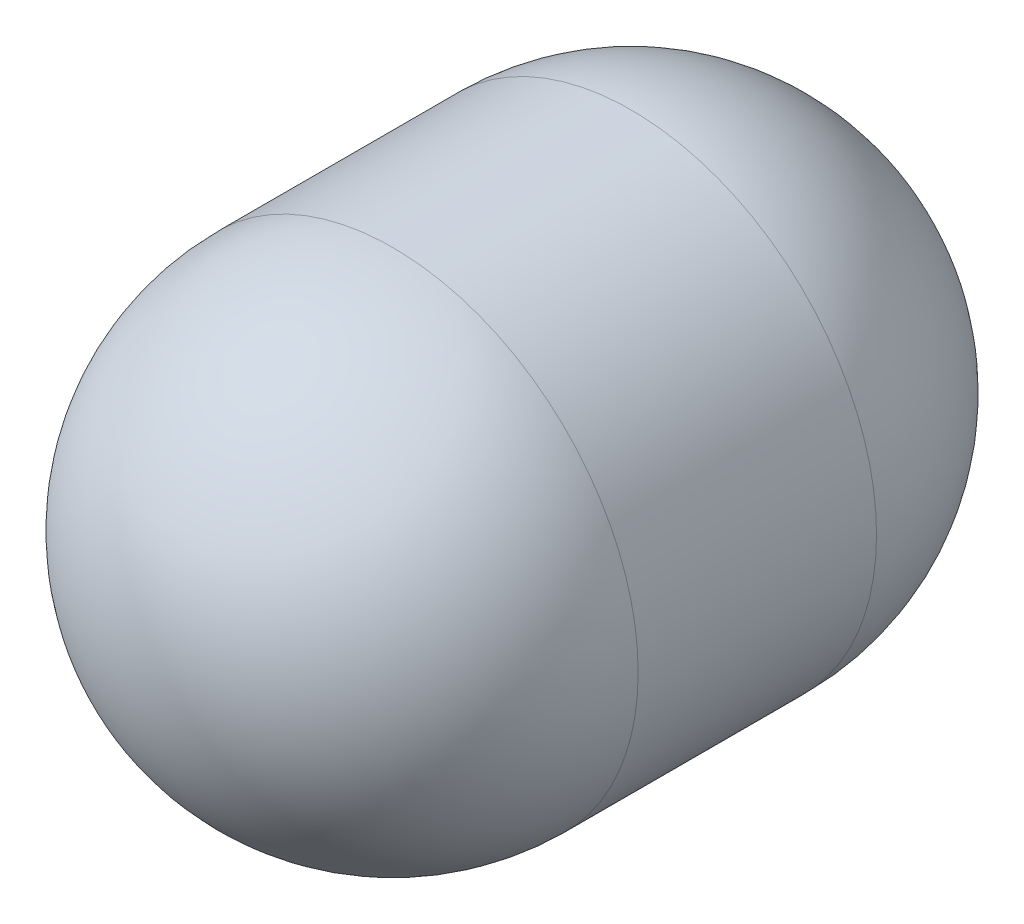
ISO-10303-21;
HEADER;
FILE_DESCRIPTION(('STEP AP214'),'2;1');
FILE_NAME('part.step','',(''),(''),'','','');
FILE_SCHEMA(('AUTOMOTIVE_DESIGN { 1 0 10303 214 1 1 1 1 }'));
ENDSEC;
DATA;
#1=APPLICATION_CONTEXT('core data for automotive mechanical design processes');
#2=APPLICATION_PROTOCOL_DEFINITION('international standard','automotive_design',2000,#1);
#3=PRODUCT_CONTEXT('',#1,'mechanical');
#4=PRODUCT('Part','Part','',(#3));
#5=PRODUCT_RELATED_PRODUCT_CATEGORY('part','',(#4));
#6=PRODUCT_DEFINITION_FORMATION('','',#4);
#7=PRODUCT_DEFINITION_CONTEXT('part definition',#1,'design');
#8=PRODUCT_DEFINITION('design','',#6,#7);
#9=PRODUCT_DEFINITION_SHAPE('','',#8);
#10=(LENGTH_UNIT() NAMED_UNIT(*) SI_UNIT(.MILLI.,.METRE.));
#11=(NAMED_UNIT(*) PLANE_ANGLE_UNIT() SI_UNIT($,.RADIAN.));
#12=(NAMED_UNIT(*) SI_UNIT($,.STERADIAN.) SOLID_ANGLE_UNIT());
#13=UNCERTAINTY_MEASURE_WITH_UNIT(LENGTH_MEASURE(1.E-05),#10,'distance_accuracy_value','');
#14=(GEOMETRIC_REPRESENTATION_CONTEXT(3) GLOBAL_UNCERTAINTY_ASSIGNED_CONTEXT((#13)) GLOBAL_UNIT_ASSIGNED_CONTEXT((#10,
#11,#12)) REPRESENTATION_CONTEXT('',''));
#15=CARTESIAN_POINT('',(0.,0.,0.));
#16=DIRECTION('',(0.,0.,1.));
#17=DIRECTION('',(1.,0.,0.));
#18=AXIS2_PLACEMENT_3D('',#15,#16,#17);
#19=CARTESIAN_POINT('',(0.,0.,-80.6816221177886));
#20=DIRECTION('',(0.,0.,-1.));
#21=DIRECTION('',(-1.,0.,0.));
#22=AXIS2_PLACEMENT_3D('',#19,#20,#21);
#23=CYLINDRICAL_SURFACE('',#22,55.5625);
#24=CARTESIAN_POINT('',(0.,0.,-26.9875));
#25=DIRECTION('',(0.,0.,-1.));
#26=DIRECTION('',(-1.,0.,0.));
#27=AXIS2_PLACEMENT_3D('',#24,#25,#26);
#28=CIRCLE('',#27,55.5625);
#29=CARTESIAN_POINT('',(-55.5625,0.,-26.9875));
#30=VERTEX_POINT('',#29);
#31=EDGE_CURVE('E10',#30,#30,#28,.T.);
#32=ORIENTED_EDGE('',*,*,#31,.F.);
#33=EDGE_LOOP('',(#32));
#34=FACE_BOUND('',#33,.T.);
#35=CARTESIAN_POINT('',(0.,0.,26.9875));
#36=DIRECTION('',(0.,0.,-1.));
#37=DIRECTION('',(-1.,0.,0.));
#38=AXIS2_PLACEMENT_3D('',#35,#36,#37);
#39=CIRCLE('',#38,55.5625);
#40=CARTESIAN_POINT('',(-55.5625,0.,26.9875));
#41=VERTEX_POINT('',#40);
#42=EDGE_CURVE('E51',#41,#41,#39,.T.);
#43=ORIENTED_EDGE('',*,*,#42,.T.);
#44=EDGE_LOOP('',(#43));
#45=FACE_BOUND('',#44,.T.);
#46=ADVANCED_FACE('F41',(#34,#45),#23,.T.);
#47=CARTESIAN_POINT('',(0.,0.,-26.9875));
#48=DIRECTION('',(0.,0.,-1.));
#49=DIRECTION('',(1.,0.,0.));
#50=AXIS2_PLACEMENT_3D('',#47,#48,#49);
#51=SPHERICAL_SURFACE('',#50,55.5625);
#52=CARTESIAN_POINT('',(0.,0.,-80.6816221177886));
#53=DIRECTION('',(0.,0.,-1.));
#54=DIRECTION('',(-1.,0.,0.));
#55=AXIS2_PLACEMENT_3D('',#52,#53,#54);
#56=CIRCLE('',#55,14.2875);
#57=CARTESIAN_POINT('',(-14.2875,0.,-80.6816221177886));
#58=VERTEX_POINT('',#57);
#59=EDGE_CURVE('E47',#58,#58,#56,.T.);
#60=ORIENTED_EDGE('',*,*,#59,.F.);
#61=EDGE_LOOP('',(#60));
#62=FACE_BOUND('',#61,.T.);
#63=ORIENTED_EDGE('',*,*,#31,.T.);
#64=EDGE_LOOP('',(#63));
#65=FACE_BOUND('',#64,.T.);
#66=ADVANCED_FACE('F66',(#62,#65),#51,.T.);
#67=CARTESIAN_POINT('',(0.,0.,-80.6816221177886));
#68=DIRECTION('',(0.,0.,-1.));
#69=DIRECTION('',(-1.,0.,0.));
#70=AXIS2_PLACEMENT_3D('',#67,#68,#69);
#71=PLANE('',#70);
#72=ORIENTED_EDGE('',*,*,#59,.T.);
#73=EDGE_LOOP('',(#72));
#74=FACE_BOUND('',#73,.T.);
#75=ADVANCED_FACE('F61',(#74),#71,.T.);
#76=CARTESIAN_POINT('',(0.,0.,26.9875));
#77=DIRECTION('',(0.,0.,-1.));
#78=DIRECTION('',(1.,0.,0.));
#79=AXIS2_PLACEMENT_3D('',#76,#77,#78);
#80=SPHERICAL_SURFACE('',#79,55.5625);
#81=ORIENTED_EDGE('',*,*,#42,.F.);
#82=EDGE_LOOP('',(#81));
#83=FACE_BOUND('',#82,.T.);
#84=ADVANCED_FACE('F59',(#83),#80,.T.);
#85=CLOSED_SHELL('',(#46,#66,#75,#84));
#86=MANIFOLD_SOLID_BREP('B2',#85);
#87=ADVANCED_BREP_SHAPE_REPRESENTATION('',(#18,#86),#14);
#88=SHAPE_DEFINITION_REPRESENTATION(#9,#87);
ENDSEC;
END-ISO-10303-21;
